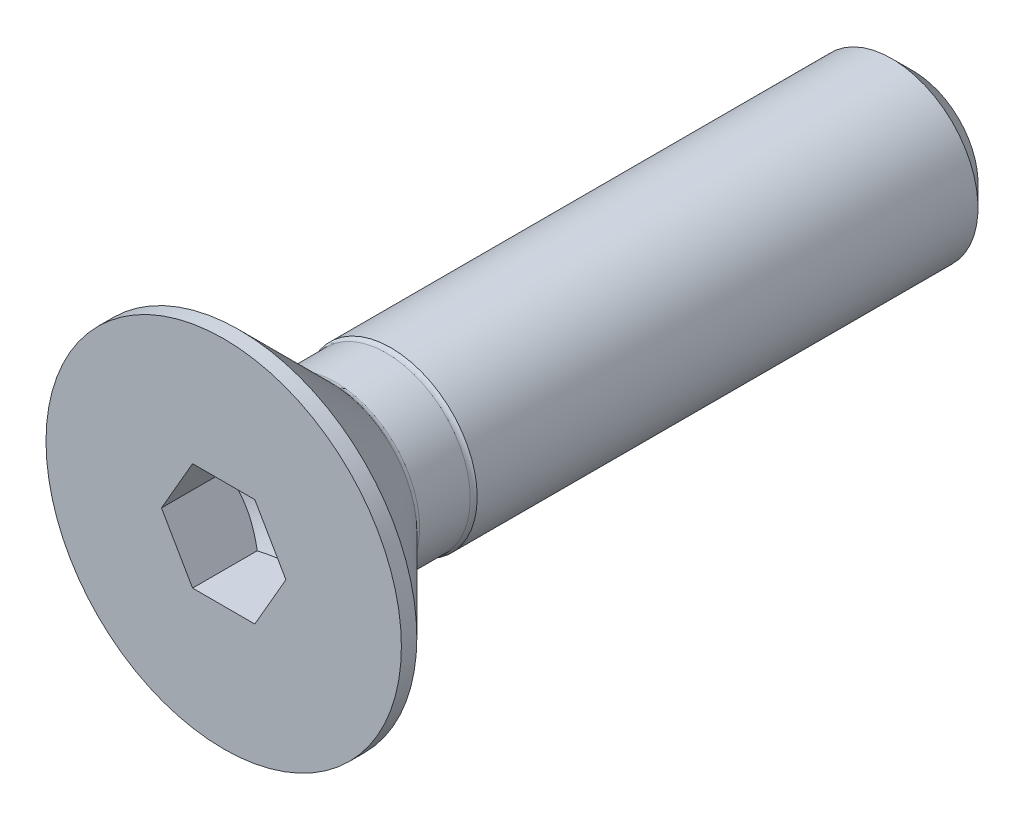
ISO-10303-21;
HEADER;
FILE_DESCRIPTION(('STEP AP214'),'2;1');
FILE_NAME('part.step','',(''),(''),'','','');
FILE_SCHEMA(('AUTOMOTIVE_DESIGN { 1 0 10303 214 1 1 1 1 }'));
ENDSEC;
DATA;
#1=APPLICATION_CONTEXT('core data for automotive mechanical design processes');
#2=APPLICATION_PROTOCOL_DEFINITION('international standard','automotive_design',2000,#1);
#3=PRODUCT_CONTEXT('',#1,'mechanical');
#4=PRODUCT('Part','Part','',(#3));
#5=PRODUCT_RELATED_PRODUCT_CATEGORY('part','',(#4));
#6=PRODUCT_DEFINITION_FORMATION('','',#4);
#7=PRODUCT_DEFINITION_CONTEXT('part definition',#1,'design');
#8=PRODUCT_DEFINITION('design','',#6,#7);
#9=PRODUCT_DEFINITION_SHAPE('','',#8);
#10=(LENGTH_UNIT() NAMED_UNIT(*) SI_UNIT(.MILLI.,.METRE.));
#11=(NAMED_UNIT(*) PLANE_ANGLE_UNIT() SI_UNIT($,.RADIAN.));
#12=(NAMED_UNIT(*) SI_UNIT($,.STERADIAN.) SOLID_ANGLE_UNIT());
#13=UNCERTAINTY_MEASURE_WITH_UNIT(LENGTH_MEASURE(1.E-05),#10,'distance_accuracy_value','');
#14=(GEOMETRIC_REPRESENTATION_CONTEXT(3) GLOBAL_UNCERTAINTY_ASSIGNED_CONTEXT((#13)) GLOBAL_UNIT_ASSIGNED_CONTEXT((#10,
#11,#12)) REPRESENTATION_CONTEXT('',''));
#15=CARTESIAN_POINT('',(0.,0.,0.));
#16=DIRECTION('',(0.,0.,1.));
#17=DIRECTION('',(1.,0.,0.));
#18=AXIS2_PLACEMENT_3D('',#15,#16,#17);
#19=CARTESIAN_POINT('',(0.,4.1225,0.));
#20=DIRECTION('',(0.,0.,-1.));
#21=DIRECTION('',(-1.,0.,0.));
#22=AXIS2_PLACEMENT_3D('',#19,#20,#21);
#23=PLANE('',#22);
#24=CARTESIAN_POINT('',(0.,0.,0.));
#25=DIRECTION('',(0.,0.,1.));
#26=DIRECTION('',(1.,0.,0.));
#27=AXIS2_PLACEMENT_3D('',#24,#25,#26);
#28=CIRCLE('',#27,4.1225);
#29=CARTESIAN_POINT('',(4.1225,0.,0.));
#30=VERTEX_POINT('',#29);
#31=EDGE_CURVE('E145',#30,#30,#28,.T.);
#32=ORIENTED_EDGE('',*,*,#31,.T.);
#33=EDGE_LOOP('',(#32));
#34=FACE_BOUND('',#33,.T.);
#35=DIRECTION('',(0.5,-0.866025403784439,0.));
#36=VECTOR('',#35,1.);
#37=CARTESIAN_POINT('',(0.7216875,1.24999941718736,0.));
#38=LINE('',#37,#36);
#39=CARTESIAN_POINT('',(0.7216875,1.24999941718736,0.));
#40=VERTEX_POINT('',#39);
#41=CARTESIAN_POINT('',(1.443375,0.,0.));
#42=VERTEX_POINT('',#41);
#43=EDGE_CURVE('E58',#40,#42,#38,.T.);
#44=ORIENTED_EDGE('',*,*,#43,.T.);
#45=DIRECTION('',(-0.5,-0.866025403784439,0.));
#46=VECTOR('',#45,1.);
#47=CARTESIAN_POINT('',(1.443375,0.,0.));
#48=LINE('',#47,#46);
#49=CARTESIAN_POINT('',(0.7216875,-1.24999941718736,0.));
#50=VERTEX_POINT('',#49);
#51=EDGE_CURVE('E172',#42,#50,#48,.T.);
#52=ORIENTED_EDGE('',*,*,#51,.T.);
#53=DIRECTION('',(-1.,0.,0.));
#54=VECTOR('',#53,1.);
#55=CARTESIAN_POINT('',(0.7216875,-1.24999941718736,0.));
#56=LINE('',#55,#54);
#57=CARTESIAN_POINT('',(-0.7216875,-1.24999941718736,0.));
#58=VERTEX_POINT('',#57);
#59=EDGE_CURVE('E478',#50,#58,#56,.T.);
#60=ORIENTED_EDGE('',*,*,#59,.T.);
#61=DIRECTION('',(-0.5,0.866025403784439,0.));
#62=VECTOR('',#61,1.);
#63=CARTESIAN_POINT('',(-0.7216875,-1.24999941718736,0.));
#64=LINE('',#63,#62);
#65=CARTESIAN_POINT('',(-1.443375,0.,0.));
#66=VERTEX_POINT('',#65);
#67=EDGE_CURVE('E474',#58,#66,#64,.T.);
#68=ORIENTED_EDGE('',*,*,#67,.T.);
#69=DIRECTION('',(0.5,0.866025403784439,0.));
#70=VECTOR('',#69,1.);
#71=CARTESIAN_POINT('',(-1.443375,0.,0.));
#72=LINE('',#71,#70);
#73=CARTESIAN_POINT('',(-0.7216875,1.24999941718736,0.));
#74=VERTEX_POINT('',#73);
#75=EDGE_CURVE('E130',#66,#74,#72,.T.);
#76=ORIENTED_EDGE('',*,*,#75,.T.);
#77=DIRECTION('',(1.,0.,0.));
#78=VECTOR('',#77,1.);
#79=CARTESIAN_POINT('',(-0.7216875,1.24999941718736,0.));
#80=LINE('',#79,#78);
#81=EDGE_CURVE('E122',#74,#40,#80,.T.);
#82=ORIENTED_EDGE('',*,*,#81,.T.);
#83=EDGE_LOOP('',(#44,#52,#60,#68,#76,#82));
#84=FACE_BOUND('',#83,.T.);
#85=ADVANCED_FACE('F43',(#34,#84),#23,.F.);
#86=CARTESIAN_POINT('',(0.,0.,-3.76786291501016));
#87=DIRECTION('',(0.,0.,1.));
#88=DIRECTION('',(1.,0.,0.));
#89=AXIS2_PLACEMENT_3D('',#86,#87,#88);
#90=TOROIDAL_SURFACE('',#89,2.11313708498985,0.16);
#91=CARTESIAN_POINT('',(0.,0.,-3.881));
#92=DIRECTION('',(0.,0.,-1.));
#93=DIRECTION('',(-1.,0.,0.));
#94=AXIS2_PLACEMENT_3D('',#91,#92,#93);
#95=CIRCLE('',#94,2.);
#96=CARTESIAN_POINT('',(-2.,0.,-3.881));
#97=VERTEX_POINT('',#96);
#98=EDGE_CURVE('E457',#97,#97,#95,.T.);
#99=ORIENTED_EDGE('',*,*,#98,.F.);
#100=EDGE_LOOP('',(#99));
#101=FACE_BOUND('',#100,.T.);
#102=CARTESIAN_POINT('',(0.,0.,-3.76786291501016));
#103=DIRECTION('',(0.,0.,1.));
#104=DIRECTION('',(1.,0.,0.));
#105=AXIS2_PLACEMENT_3D('',#102,#103,#104);
#106=CIRCLE('',#105,1.95313708498985);
#107=CARTESIAN_POINT('',(1.95313708498985,0.,-3.76786291501016));
#108=VERTEX_POINT('',#107);
#109=EDGE_CURVE('E256',#108,#108,#106,.T.);
#110=ORIENTED_EDGE('',*,*,#109,.F.);
#111=EDGE_LOOP('',(#110));
#112=FACE_BOUND('',#111,.T.);
#113=ADVANCED_FACE('F227',(#101,#112),#90,.F.);
#114=CARTESIAN_POINT('',(0.,0.,0.));
#115=DIRECTION('',(0.,0.,1.));
#116=DIRECTION('',(1.,0.,0.));
#117=AXIS2_PLACEMENT_3D('',#114,#115,#116);
#118=CYLINDRICAL_SURFACE('',#117,1.95313708498985);
#119=CARTESIAN_POINT('',(0.,0.,-2.59413708498985));
#120=DIRECTION('',(0.,0.,-1.));
#121=DIRECTION('',(-1.,0.,0.));
#122=AXIS2_PLACEMENT_3D('',#119,#120,#121);
#123=CIRCLE('',#122,1.95313708498985);
#124=CARTESIAN_POINT('',(-1.95313708498985,0.,-2.59413708498985));
#125=VERTEX_POINT('',#124);
#126=EDGE_CURVE('E254',#125,#125,#123,.T.);
#127=ORIENTED_EDGE('',*,*,#126,.T.);
#128=EDGE_LOOP('',(#127));
#129=FACE_BOUND('',#128,.T.);
#130=ORIENTED_EDGE('',*,*,#109,.T.);
#131=EDGE_LOOP('',(#130));
#132=FACE_BOUND('',#131,.T.);
#133=ADVANCED_FACE('F233',(#129,#132),#118,.T.);
#134=CARTESIAN_POINT('',(0.,0.,-2.481));
#135=DIRECTION('',(0.,0.,1.));
#136=DIRECTION('',(1.,0.,0.));
#137=AXIS2_PLACEMENT_3D('',#134,#135,#136);
#138=CONICAL_SURFACE('',#137,2.,0.785398163397448);
#139=CARTESIAN_POINT('',(0.,0.,-2.481));
#140=DIRECTION('',(0.,0.,1.));
#141=DIRECTION('',(1.,0.,0.));
#142=AXIS2_PLACEMENT_3D('',#139,#140,#141);
#143=CIRCLE('',#142,2.);
#144=CARTESIAN_POINT('',(2.,0.,-2.481));
#145=VERTEX_POINT('',#144);
#146=EDGE_CURVE('E251',#145,#145,#143,.T.);
#147=ORIENTED_EDGE('',*,*,#146,.T.);
#148=EDGE_LOOP('',(#147));
#149=FACE_BOUND('',#148,.T.);
#150=CARTESIAN_POINT('',(0.,0.,-0.3585));
#151=DIRECTION('',(0.,0.,1.));
#152=DIRECTION('',(1.,0.,0.));
#153=AXIS2_PLACEMENT_3D('',#150,#151,#152);
#154=CIRCLE('',#153,4.1225);
#155=CARTESIAN_POINT('',(4.1225,0.,-0.3585));
#156=VERTEX_POINT('',#155);
#157=EDGE_CURVE('E150',#156,#156,#154,.T.);
#158=ORIENTED_EDGE('',*,*,#157,.F.);
#159=EDGE_LOOP('',(#158));
#160=FACE_BOUND('',#159,.T.);
#161=ADVANCED_FACE('F289',(#149,#160),#138,.T.);
#162=CARTESIAN_POINT('',(0.,0.,0.));
#163=DIRECTION('',(0.,0.,1.));
#164=DIRECTION('',(1.,0.,0.));
#165=AXIS2_PLACEMENT_3D('',#162,#163,#164);
#166=CYLINDRICAL_SURFACE('',#165,4.1225);
#167=ORIENTED_EDGE('',*,*,#31,.F.);
#168=EDGE_LOOP('',(#167));
#169=FACE_BOUND('',#168,.T.);
#170=ORIENTED_EDGE('',*,*,#157,.T.);
#171=EDGE_LOOP('',(#170));
#172=FACE_BOUND('',#171,.T.);
#173=ADVANCED_FACE('F225',(#169,#172),#166,.T.);
#174=CARTESIAN_POINT('',(0.7216875,1.24999941718736,-2.33333294479158));
#175=DIRECTION('',(-0.866025403784439,-0.5,0.));
#176=DIRECTION('',(-0.5,0.866025403784438,0.));
#177=AXIS2_PLACEMENT_3D('',#174,#175,#176);
#178=PLANE('',#177);
#179=DIRECTION('',(0.,0.,1.));
#180=VECTOR('',#179,1.);
#181=CARTESIAN_POINT('',(1.443375,0.,-2.33333294479158));
#182=LINE('',#181,#180);
#183=CARTESIAN_POINT('',(1.443375,0.,-1.5));
#184=VERTEX_POINT('',#183);
#185=EDGE_CURVE('E142',#184,#42,#182,.T.);
#186=ORIENTED_EDGE('',*,*,#185,.T.);
#187=ORIENTED_EDGE('',*,*,#43,.F.);
#188=DIRECTION('',(0.,0.,1.));
#189=VECTOR('',#188,1.);
#190=CARTESIAN_POINT('',(0.7216875,1.24999941718736,-2.33333294479158));
#191=LINE('',#190,#189);
#192=CARTESIAN_POINT('',(0.7216875,1.24999941718736,-1.5));
#193=VERTEX_POINT('',#192);
#194=EDGE_CURVE('E115',#193,#40,#191,.T.);
#195=ORIENTED_EDGE('',*,*,#194,.F.);
#196=CARTESIAN_POINT('',(1.44337615470054,-2.0000000000854E-06,-1.49999933333253));
#197=CARTESIAN_POINT('',(1.41166234028678,0.0549279378664328,-1.51831466384599));
#198=CARTESIAN_POINT('',(1.37967477272109,0.110332030100753,-1.534971506758));
#199=CARTESIAN_POINT('',(1.31514579266581,0.222099502117095,-1.56404554497845));
#200=CARTESIAN_POINT('',(1.28260323398259,0.278464867164723,-1.57645245608369));
#201=CARTESIAN_POINT('',(1.2179214008177,0.390497088533009,-1.59576473395903));
#202=CARTESIAN_POINT('',(1.18579207575664,0.446146711951657,-1.60279864918316));
#203=CARTESIAN_POINT('',(1.12138232312734,0.557707676008561,-1.61119415112888));
#204=CARTESIAN_POINT('',(1.08910212951503,0.613618611423234,-1.6125626916718));
#205=CARTESIAN_POINT('',(1.02878989848834,0.718082459879302,-1.60970859848893));
#206=CARTESIAN_POINT('',(1.00074881136366,0.766651047478698,-1.60618673930223));
#207=CARTESIAN_POINT('',(0.944849315909161,0.863471813723364,-1.59502670475172));
#208=CARTESIAN_POINT('',(0.916991100780737,0.911723657733979,-1.58738472076412));
#209=CARTESIAN_POINT('',(0.860976444321451,1.00874388868998,-1.56828121424634));
#210=CARTESIAN_POINT('',(0.832827088932361,1.05750000242419,-1.55673874987155));
#211=CARTESIAN_POINT('',(0.776948107685497,1.15428523701895,-1.5305422256394));
#212=CARTESIAN_POINT('',(0.749217766489108,1.20231559688232,-1.51589431709011));
#213=CARTESIAN_POINT('',(0.721686345299461,1.25000141718736,-1.49999933333253));
#214=B_SPLINE_CURVE_WITH_KNOTS('',3,(#196,#197,#198,#199,#200,#201,#202,#203,#204,#205,#206,
#207,#208,#209,#210,#211,#212,#213),.UNSPECIFIED.,.F.,.F.,(4,2,2,2,2,2,2,2,4),(0.,
0.198135072963001,0.396746271230005,0.590442442133858,0.783900794935013,0.952318546997791,
1.12089225123217,1.29320414395206,1.46517785562982),.UNSPECIFIED.);
#215=EDGE_CURVE('E107',#184,#193,#214,.T.);
#216=ORIENTED_EDGE('',*,*,#215,.F.);
#217=EDGE_LOOP('',(#186,#187,#195,#216));
#218=FACE_BOUND('',#217,.T.);
#219=ADVANCED_FACE('F116',(#218),#178,.T.);
#220=CARTESIAN_POINT('',(1.443375,0.,-2.33333294479158));
#221=DIRECTION('',(-0.866025403784439,0.5,0.));
#222=DIRECTION('',(0.5,0.866025403784439,0.));
#223=AXIS2_PLACEMENT_3D('',#220,#221,#222);
#224=PLANE('',#223);
#225=DIRECTION('',(0.,0.,1.));
#226=VECTOR('',#225,1.);
#227=CARTESIAN_POINT('',(0.7216875,-1.24999941718736,-2.33333294479158));
#228=LINE('',#227,#226);
#229=CARTESIAN_POINT('',(0.7216875,-1.24999941718736,-1.5));
#230=VERTEX_POINT('',#229);
#231=EDGE_CURVE('E139',#230,#50,#228,.T.);
#232=ORIENTED_EDGE('',*,*,#231,.T.);
#233=ORIENTED_EDGE('',*,*,#51,.F.);
#234=ORIENTED_EDGE('',*,*,#185,.F.);
#235=CARTESIAN_POINT('',(0.721686345299462,-1.25000141718736,-1.49999933333253));
#236=CARTESIAN_POINT('',(0.753400159713217,-1.19507147932093,-1.51831466384599));
#237=CARTESIAN_POINT('',(0.785387727278908,-1.13966738708661,-1.534971506758));
#238=CARTESIAN_POINT('',(0.849916707334187,-1.02789991507027,-1.56404554497845));
#239=CARTESIAN_POINT('',(0.882459266017407,-0.971534550022641,-1.57645245608369));
#240=CARTESIAN_POINT('',(0.947141099182298,-0.859502328654354,-1.59576473395903));
#241=CARTESIAN_POINT('',(0.979270424243356,-0.803852705235707,-1.60279864918316));
#242=CARTESIAN_POINT('',(1.04368017687266,-0.692291741178803,-1.61119415112888));
#243=CARTESIAN_POINT('',(1.07596037048497,-0.63638080576413,-1.6125626916718));
#244=CARTESIAN_POINT('',(1.13627260151166,-0.531916957308062,-1.60970859848893));
#245=CARTESIAN_POINT('',(1.16431368863634,-0.483348369708666,-1.60618673930223));
#246=CARTESIAN_POINT('',(1.22021318409084,-0.386527603463999,-1.59502670475172));
#247=CARTESIAN_POINT('',(1.24807139921926,-0.338275759453384,-1.58738472076412));
#248=CARTESIAN_POINT('',(1.30408605567855,-0.241255528497385,-1.56828121424634));
#249=CARTESIAN_POINT('',(1.33223541106764,-0.192499414763169,-1.55673874987155));
#250=CARTESIAN_POINT('',(1.3881143923145,-0.095714180168412,-1.5305422256394));
#251=CARTESIAN_POINT('',(1.41584473351089,-0.0476838203050459,-1.51589431709011));
#252=CARTESIAN_POINT('',(1.44337615470054,2.00000000011121E-06,-1.49999933333253));
#253=B_SPLINE_CURVE_WITH_KNOTS('',3,(#235,#236,#237,#238,#239,#240,#241,#242,#243,#244,#245,
#246,#247,#248,#249,#250,#251,#252),.UNSPECIFIED.,.F.,.F.,(4,2,2,2,2,2,2,2,4),(0.,
0.198135072963001,0.396746271230005,0.590442442133857,0.783900794935012,0.95231854699779,
1.12089225123217,1.29320414395206,1.46517785562982),.UNSPECIFIED.);
#254=EDGE_CURVE('E111',#230,#184,#253,.T.);
#255=ORIENTED_EDGE('',*,*,#254,.F.);
#256=EDGE_LOOP('',(#232,#233,#234,#255));
#257=FACE_BOUND('',#256,.T.);
#258=ADVANCED_FACE('F216',(#257),#224,.T.);
#259=CARTESIAN_POINT('',(0.7216875,-1.24999941718736,-2.33333294479158));
#260=DIRECTION('',(0.,1.,0.));
#261=DIRECTION('',(1.,0.,0.));
#262=AXIS2_PLACEMENT_3D('',#259,#260,#261);
#263=PLANE('',#262);
#264=DIRECTION('',(0.,0.,1.));
#265=VECTOR('',#264,1.);
#266=CARTESIAN_POINT('',(-0.7216875,-1.24999941718736,-2.33333294479158));
#267=LINE('',#266,#265);
#268=CARTESIAN_POINT('',(-0.7216875,-1.24999941718736,-1.5));
#269=VERTEX_POINT('',#268);
#270=EDGE_CURVE('E136',#269,#58,#267,.T.);
#271=ORIENTED_EDGE('',*,*,#270,.T.);
#272=ORIENTED_EDGE('',*,*,#59,.F.);
#273=ORIENTED_EDGE('',*,*,#231,.F.);
#274=CARTESIAN_POINT('',(-1.86893053107489,-1.24999941718736,-1.03520610546338));
#275=CARTESIAN_POINT('',(-1.81495117776836,-1.24999941718736,-1.06110336553914));
#276=CARTESIAN_POINT('',(-1.76084043441986,-1.24999941718736,-1.08673156982417));
#277=CARTESIAN_POINT('',(-1.65228585942289,-1.24999941718736,-1.13729740698206));
#278=CARTESIAN_POINT('',(-1.59784196995446,-1.24999941718736,-1.16223491557562));
#279=CARTESIAN_POINT('',(-1.48823862830604,-1.24999941718736,-1.21140621587152));
#280=CARTESIAN_POINT('',(-1.43307683885742,-1.24999941718736,-1.235634821182));
#281=CARTESIAN_POINT('',(-1.32229127521218,-1.24999941718736,-1.28300502760232));
#282=CARTESIAN_POINT('',(-1.26666752521415,-1.24999941718736,-1.30614668523167));
#283=CARTESIAN_POINT('',(-1.15340030068293,-1.24999941718736,-1.35164545298225));
#284=CARTESIAN_POINT('',(-1.09574203904477,-1.24999941718736,-1.37396624053161));
#285=CARTESIAN_POINT('',(-0.979740631963517,-1.24999941718736,-1.4167445598185));
#286=CARTESIAN_POINT('',(-0.921397401730978,-1.24999941718736,-1.43720185807762));
#287=CARTESIAN_POINT('',(-0.745435180245369,-1.24999941718736,-1.4949157638346));
#288=CARTESIAN_POINT('',(-0.626561647576072,-1.24999941718736,-1.5286497713202));
#289=CARTESIAN_POINT('',(-0.445872875814715,-1.24999941718736,-1.56777956156641));
#290=CARTESIAN_POINT('',(-0.385304520505474,-1.24999941718736,-1.57890590259941));
#291=CARTESIAN_POINT('',(-0.263486469039549,-1.24999941718736,-1.59657210272847));
#292=CARTESIAN_POINT('',(-0.20223681921018,-1.24999941718736,-1.60311227176594));
#293=CARTESIAN_POINT('',(-0.0801324091719259,-1.24999941718736,-1.61100116721612));
#294=CARTESIAN_POINT('',(-0.0192817104364654,-1.24999941718736,-1.61241115633369));
#295=CARTESIAN_POINT('',(0.102319185361569,-1.24999941718736,-1.61008376076964));
#296=CARTESIAN_POINT('',(0.163069375967905,-1.24999941718736,-1.60634605736359));
#297=CARTESIAN_POINT('',(0.312961455362286,-1.24999941718736,-1.59110192923387));
#298=CARTESIAN_POINT('',(0.40181287263432,-1.24999941718736,-1.57673871507949));
#299=CARTESIAN_POINT('',(0.577787885436386,-1.24999941718736,-1.53970013003255));
#300=CARTESIAN_POINT('',(0.664909264565295,-1.24999941718736,-1.5170147409968));
#301=CARTESIAN_POINT('',(0.795208864990652,-1.24999941718736,-1.47826255341911));
#302=CARTESIAN_POINT('',(0.839060620655932,-1.24999941718736,-1.46437706854983));
#303=CARTESIAN_POINT('',(0.926307663712635,-1.24999941718736,-1.43532161198726));
#304=CARTESIAN_POINT('',(0.969703217226752,-1.24999941718736,-1.42015244191295));
#305=CARTESIAN_POINT('',(1.05609584795378,-1.24999941718736,-1.38874991589815));
#306=CARTESIAN_POINT('',(1.09909299597128,-1.24999941718736,-1.37251675335748));
#307=CARTESIAN_POINT('',(1.18474848915208,-1.24999941718736,-1.33916183010982));
#308=CARTESIAN_POINT('',(1.22740677566046,-1.24999941718736,-1.32203991927052));
#309=CARTESIAN_POINT('',(1.33629337906013,-1.24999941718736,-1.27723891874489));
#310=CARTESIAN_POINT('',(1.40230397627436,-1.24999941718736,-1.24903123787647));
#311=CARTESIAN_POINT('',(1.53372907463052,-1.24999941718736,-1.19125610878032));
#312=CARTESIAN_POINT('',(1.59914353067597,-1.24999941718736,-1.16168855868857));
#313=CARTESIAN_POINT('',(1.79469131828896,-1.24999941718736,-1.07142547137653));
#314=CARTESIAN_POINT('',(1.92410722703437,-1.24999941718736,-1.00917875067825));
#315=CARTESIAN_POINT('',(2.18183340208154,-1.24999941718736,-0.882074692722761));
#316=CARTESIAN_POINT('',(2.31014211360569,-1.24999941718736,-0.817214240230098));
#317=CARTESIAN_POINT('',(2.565880437641,-1.24999941718736,-0.685825560455861));
#318=CARTESIAN_POINT('',(2.69331015929244,-1.24999941718736,-0.619297545160823));
#319=CARTESIAN_POINT('',(2.93556233058972,-1.24999941718736,-0.491426204179085));
#320=CARTESIAN_POINT('',(3.05043950275986,-1.24999941718736,-0.430186190566507));
#321=CARTESIAN_POINT('',(3.27982431975772,-1.24999941718736,-0.307008392995773));
#322=CARTESIAN_POINT('',(3.39433195070739,-1.24999941718736,-0.245070583215423));
#323=CARTESIAN_POINT('',(3.62277162051502,-1.24999941718736,-0.120830385501942));
#324=CARTESIAN_POINT('',(3.73670438259663,-1.24999941718736,-0.0585293255792196));
#325=CARTESIAN_POINT('',(3.96433956104115,-1.24999941718736,0.0664782860853304));
#326=CARTESIAN_POINT('',(4.07804198914646,-1.24999941718736,0.129184816436423));
#327=CARTESIAN_POINT('',(4.19166166337244,-1.24999941718736,0.192040033810125));
#328=B_SPLINE_CURVE_WITH_KNOTS('',3,(#274,#275,#276,#277,#278,#279,#280,#281,#282,#283,#284,
#285,#286,#287,#288,#289,#290,#291,#292,#293,#294,#295,#296,#297,#298,#299,#300,#301,#302,#303,
#304,#305,#306,#307,#308,#309,#310,#311,#312,#313,#314,#315,#316,#317,#318,#319,#320,#321,#322,
#323,#324,#325,#326,#327),.UNSPECIFIED.,.F.,.F.,(4,2,2,2,2,2,2,2,2,2,2,2,2,2,2,2,2,2,2,2,2,2,2,
2,2,2,4),(0.,0.179612840817484,0.359257792773137,0.539992477393522,0.720717753677289,
0.906167353114827,1.09164015584897,1.46153946542598,1.64614477745769,1.83073761234132,
2.01311873652213,2.1955111535168,2.46497183475509,2.73475795996105,2.87273569413165,
3.01062789275234,3.14849509611698,3.28638566505407,3.50171816734966,3.71706682595868,
4.14783526963883,4.5791332693121,5.01037671616215,5.40091711572386,5.79147201515411,
6.18103353481212,6.57057466801426),.UNSPECIFIED.);
#329=EDGE_CURVE('E205',#269,#230,#328,.T.);
#330=ORIENTED_EDGE('',*,*,#329,.F.);
#331=EDGE_LOOP('',(#271,#272,#273,#330));
#332=FACE_BOUND('',#331,.T.);
#333=ADVANCED_FACE('F212',(#332),#263,.T.);
#334=CARTESIAN_POINT('',(-0.7216875,-1.24999941718736,-2.33333294479158));
#335=DIRECTION('',(0.866025403784439,0.5,0.));
#336=DIRECTION('',(0.5,-0.866025403784439,0.));
#337=AXIS2_PLACEMENT_3D('',#334,#335,#336);
#338=PLANE('',#337);
#339=DIRECTION('',(0.,0.,1.));
#340=VECTOR('',#339,1.);
#341=CARTESIAN_POINT('',(-1.443375,0.,-2.33333294479158));
#342=LINE('',#341,#340);
#343=CARTESIAN_POINT('',(-1.443375,0.,-1.5));
#344=VERTEX_POINT('',#343);
#345=EDGE_CURVE('E128',#344,#66,#342,.T.);
#346=ORIENTED_EDGE('',*,*,#345,.T.);
#347=ORIENTED_EDGE('',*,*,#67,.F.);
#348=ORIENTED_EDGE('',*,*,#270,.F.);
#349=CARTESIAN_POINT('',(-1.44337615470054,2.00000000041633E-06,-1.49999933333253));
#350=CARTESIAN_POINT('',(-1.41166234028678,-0.0549279378664328,-1.51831466384599));
#351=CARTESIAN_POINT('',(-1.37967477272109,-0.110332030100753,-1.534971506758));
#352=CARTESIAN_POINT('',(-1.31514579266581,-0.222099502117095,-1.56404554497845));
#353=CARTESIAN_POINT('',(-1.28260323398259,-0.278464867164722,-1.57645245608369));
#354=CARTESIAN_POINT('',(-1.2179214008177,-0.390497088533009,-1.59576473395903));
#355=CARTESIAN_POINT('',(-1.18579207575664,-0.446146711951657,-1.60279864918316));
#356=CARTESIAN_POINT('',(-1.12138232312734,-0.55770767600856,-1.61119415112888));
#357=CARTESIAN_POINT('',(-1.08910212951503,-0.613618611423234,-1.6125626916718));
#358=CARTESIAN_POINT('',(-1.02878989848834,-0.718082459879302,-1.60970859848893));
#359=CARTESIAN_POINT('',(-1.00074881136366,-0.766651047478698,-1.60618673930223));
#360=CARTESIAN_POINT('',(-0.944849315909161,-0.863471813723365,-1.59502670475172));
#361=CARTESIAN_POINT('',(-0.916991100780737,-0.911723657733979,-1.58738472076412));
#362=CARTESIAN_POINT('',(-0.860976444321451,-1.00874388868998,-1.56828121424634));
#363=CARTESIAN_POINT('',(-0.832827088932361,-1.05750000242419,-1.55673874987155));
#364=CARTESIAN_POINT('',(-0.776948107685497,-1.15428523701895,-1.5305422256394));
#365=CARTESIAN_POINT('',(-0.749217766489108,-1.20231559688232,-1.51589431709011));
#366=CARTESIAN_POINT('',(-0.721686345299461,-1.25000141718736,-1.49999933333253));
#367=B_SPLINE_CURVE_WITH_KNOTS('',3,(#349,#350,#351,#352,#353,#354,#355,#356,#357,#358,#359,
#360,#361,#362,#363,#364,#365,#366),.UNSPECIFIED.,.F.,.F.,(4,2,2,2,2,2,2,2,4),(0.,
0.198135072963001,0.396746271230005,0.590442442133858,0.783900794935013,0.952318546997791,
1.12089225123217,1.29320414395206,1.46517785562982),.UNSPECIFIED.);
#368=EDGE_CURVE('E199',#344,#269,#367,.T.);
#369=ORIENTED_EDGE('',*,*,#368,.F.);
#370=EDGE_LOOP('',(#346,#347,#348,#369));
#371=FACE_BOUND('',#370,.T.);
#372=ADVANCED_FACE('F215',(#371),#338,.T.);
#373=CARTESIAN_POINT('',(-1.443375,0.,-2.33333294479158));
#374=DIRECTION('',(0.866025403784439,-0.5,0.));
#375=DIRECTION('',(-0.5,-0.866025403784439,0.));
#376=AXIS2_PLACEMENT_3D('',#373,#374,#375);
#377=PLANE('',#376);
#378=DIRECTION('',(0.,0.,1.));
#379=VECTOR('',#378,1.);
#380=CARTESIAN_POINT('',(-0.7216875,1.24999941718736,-2.33333294479158));
#381=LINE('',#380,#379);
#382=CARTESIAN_POINT('',(-0.7216875,1.24999941718736,-1.5));
#383=VERTEX_POINT('',#382);
#384=EDGE_CURVE('E121',#383,#74,#381,.T.);
#385=ORIENTED_EDGE('',*,*,#384,.T.);
#386=ORIENTED_EDGE('',*,*,#75,.F.);
#387=ORIENTED_EDGE('',*,*,#345,.F.);
#388=CARTESIAN_POINT('',(-0.721686345299462,1.25000141718736,-1.49999933333253));
#389=CARTESIAN_POINT('',(-0.753400159713217,1.19507147932093,-1.51831466384599));
#390=CARTESIAN_POINT('',(-0.785387727278908,1.13966738708661,-1.534971506758));
#391=CARTESIAN_POINT('',(-0.849916707334187,1.02789991507027,-1.56404554497845));
#392=CARTESIAN_POINT('',(-0.882459266017407,0.971534550022641,-1.57645245608369));
#393=CARTESIAN_POINT('',(-0.947141099182299,0.859502328654354,-1.59576473395903));
#394=CARTESIAN_POINT('',(-0.979270424243356,0.803852705235707,-1.60279864918316));
#395=CARTESIAN_POINT('',(-1.04368017687266,0.692291741178803,-1.61119415112888));
#396=CARTESIAN_POINT('',(-1.07596037048497,0.636380805764129,-1.6125626916718));
#397=CARTESIAN_POINT('',(-1.13627260151166,0.531916957308061,-1.60970859848893));
#398=CARTESIAN_POINT('',(-1.16431368863634,0.483348369708665,-1.60618673930223));
#399=CARTESIAN_POINT('',(-1.22021318409084,0.386527603463999,-1.59502670475172));
#400=CARTESIAN_POINT('',(-1.24807139921926,0.338275759453385,-1.58738472076412));
#401=CARTESIAN_POINT('',(-1.30408605567855,0.241255528497386,-1.56828121424634));
#402=CARTESIAN_POINT('',(-1.33223541106764,0.192499414763169,-1.55673874987155));
#403=CARTESIAN_POINT('',(-1.3881143923145,0.0957141801684129,-1.5305422256394));
#404=CARTESIAN_POINT('',(-1.41584473351089,0.0476838203050468,-1.51589431709011));
#405=CARTESIAN_POINT('',(-1.44337615470054,-1.99999999949886E-06,-1.49999933333253));
#406=B_SPLINE_CURVE_WITH_KNOTS('',3,(#388,#389,#390,#391,#392,#393,#394,#395,#396,#397,#398,
#399,#400,#401,#402,#403,#404,#405),.UNSPECIFIED.,.F.,.F.,(4,2,2,2,2,2,2,2,4),(0.,
0.198135072963001,0.396746271230005,0.590442442133858,0.783900794935013,0.95231854699779,
1.12089225123217,1.29320414395206,1.46517785562982),.UNSPECIFIED.);
#407=EDGE_CURVE('E66',#383,#344,#406,.T.);
#408=ORIENTED_EDGE('',*,*,#407,.F.);
#409=EDGE_LOOP('',(#385,#386,#387,#408));
#410=FACE_BOUND('',#409,.T.);
#411=ADVANCED_FACE('F322',(#410),#377,.T.);
#412=CARTESIAN_POINT('',(-0.7216875,1.24999941718736,-2.33333294479158));
#413=DIRECTION('',(0.,-1.,0.));
#414=DIRECTION('',(-1.,0.,0.));
#415=AXIS2_PLACEMENT_3D('',#412,#413,#414);
#416=PLANE('',#415);
#417=ORIENTED_EDGE('',*,*,#194,.T.);
#418=ORIENTED_EDGE('',*,*,#81,.F.);
#419=ORIENTED_EDGE('',*,*,#384,.F.);
#420=CARTESIAN_POINT('',(-1.86893053107489,1.24999941718736,-1.03520610546338));
#421=CARTESIAN_POINT('',(-1.81495117776836,1.24999941718736,-1.06110336553914));
#422=CARTESIAN_POINT('',(-1.76084043441986,1.24999941718736,-1.08673156982417));
#423=CARTESIAN_POINT('',(-1.65228585942289,1.24999941718736,-1.13729740698206));
#424=CARTESIAN_POINT('',(-1.59784196995446,1.24999941718736,-1.16223491557562));
#425=CARTESIAN_POINT('',(-1.48823862830604,1.24999941718736,-1.21140621587152));
#426=CARTESIAN_POINT('',(-1.43307683885742,1.24999941718736,-1.235634821182));
#427=CARTESIAN_POINT('',(-1.32229127521218,1.24999941718736,-1.28300502760232));
#428=CARTESIAN_POINT('',(-1.26666752521415,1.24999941718736,-1.30614668523167));
#429=CARTESIAN_POINT('',(-1.15340030068293,1.24999941718736,-1.35164545298225));
#430=CARTESIAN_POINT('',(-1.09574203904477,1.24999941718736,-1.37396624053161));
#431=CARTESIAN_POINT('',(-0.979740631963518,1.24999941718736,-1.4167445598185));
#432=CARTESIAN_POINT('',(-0.921397401730978,1.24999941718736,-1.43720185807762));
#433=CARTESIAN_POINT('',(-0.74543518024537,1.24999941718736,-1.4949157638346));
#434=CARTESIAN_POINT('',(-0.626561647576073,1.24999941718736,-1.5286497713202));
#435=CARTESIAN_POINT('',(-0.445872875814716,1.24999941718736,-1.56777956156641));
#436=CARTESIAN_POINT('',(-0.385304520505475,1.24999941718736,-1.57890590259941));
#437=CARTESIAN_POINT('',(-0.26348646903955,1.24999941718736,-1.59657210272847));
#438=CARTESIAN_POINT('',(-0.202236819210181,1.24999941718736,-1.60311227176594));
#439=CARTESIAN_POINT('',(-0.0801324091719269,1.24999941718736,-1.61100116721612));
#440=CARTESIAN_POINT('',(-0.0192817104364664,1.24999941718736,-1.61241115633369));
#441=CARTESIAN_POINT('',(0.102319185361568,1.24999941718736,-1.61008376076964));
#442=CARTESIAN_POINT('',(0.163069375967904,1.24999941718736,-1.60634605736359));
#443=CARTESIAN_POINT('',(0.312961455362285,1.24999941718736,-1.59110192923387));
#444=CARTESIAN_POINT('',(0.401812872634318,1.24999941718736,-1.57673871507949));
#445=CARTESIAN_POINT('',(0.577787885436384,1.24999941718736,-1.53970013003255));
#446=CARTESIAN_POINT('',(0.664909264565294,1.24999941718736,-1.5170147409968));
#447=CARTESIAN_POINT('',(0.795208864990651,1.24999941718736,-1.47826255341911));
#448=CARTESIAN_POINT('',(0.83906062065593,1.24999941718736,-1.46437706854983));
#449=CARTESIAN_POINT('',(0.926307663712634,1.24999941718736,-1.43532161198726));
#450=CARTESIAN_POINT('',(0.96970321722675,1.24999941718736,-1.42015244191295));
#451=CARTESIAN_POINT('',(1.05609584795378,1.24999941718737,-1.38874991589815));
#452=CARTESIAN_POINT('',(1.09909299597128,1.24999941718737,-1.37251675335748));
#453=CARTESIAN_POINT('',(1.18474848915208,1.24999941718736,-1.33916183010982));
#454=CARTESIAN_POINT('',(1.22740677566045,1.24999941718736,-1.32203991927052));
#455=CARTESIAN_POINT('',(1.33629337906013,1.24999941718736,-1.27723891874489));
#456=CARTESIAN_POINT('',(1.40230397627436,1.24999941718736,-1.24903123787647));
#457=CARTESIAN_POINT('',(1.53372907463051,1.24999941718737,-1.19125610878032));
#458=CARTESIAN_POINT('',(1.59914353067597,1.24999941718737,-1.16168855868857));
#459=CARTESIAN_POINT('',(1.79469131828895,1.24999941718736,-1.07142547137653));
#460=CARTESIAN_POINT('',(1.92410722703437,1.24999941718737,-1.00917875067825));
#461=CARTESIAN_POINT('',(2.18183340208154,1.24999941718737,-0.882074692722761));
#462=CARTESIAN_POINT('',(2.31014211360569,1.24999941718737,-0.817214240230098));
#463=CARTESIAN_POINT('',(2.565880437641,1.24999941718737,-0.685825560455862));
#464=CARTESIAN_POINT('',(2.69331015929244,1.24999941718737,-0.619297545160823));
#465=CARTESIAN_POINT('',(2.93556233058972,1.24999941718737,-0.491426204179086));
#466=CARTESIAN_POINT('',(3.05043950275985,1.24999941718737,-0.430186190566508));
#467=CARTESIAN_POINT('',(3.27982431975771,1.24999941718737,-0.307008392995774));
#468=CARTESIAN_POINT('',(3.39433195070738,1.24999941718737,-0.245070583215424));
#469=CARTESIAN_POINT('',(3.62277162051502,1.24999941718737,-0.120830385501943));
#470=CARTESIAN_POINT('',(3.73670438259662,1.24999941718737,-0.0585293255792209));
#471=CARTESIAN_POINT('',(3.96433956104115,1.24999941718737,0.0664782860853295));
#472=CARTESIAN_POINT('',(4.07804198914646,1.24999941718737,0.129184816436422));
#473=CARTESIAN_POINT('',(4.19166166337243,1.24999941718737,0.192040033810125));
#474=B_SPLINE_CURVE_WITH_KNOTS('',3,(#420,#421,#422,#423,#424,#425,#426,#427,#428,#429,#430,
#431,#432,#433,#434,#435,#436,#437,#438,#439,#440,#441,#442,#443,#444,#445,#446,#447,#448,#449,
#450,#451,#452,#453,#454,#455,#456,#457,#458,#459,#460,#461,#462,#463,#464,#465,#466,#467,#468,
#469,#470,#471,#472,#473),.UNSPECIFIED.,.F.,.F.,(4,2,2,2,2,2,2,2,2,2,2,2,2,2,2,2,2,2,2,2,2,2,2,
2,2,2,4),(0.,0.179612840817484,0.359257792773137,0.539992477393522,0.720717753677288,
0.906167353114827,1.09164015584897,1.46153946542598,1.64614477745769,1.83073761234132,
2.01311873652213,2.1955111535168,2.46497183475509,2.73475795996105,2.87273569413165,
3.01062789275234,3.14849509611698,3.28638566505407,3.50171816734966,3.71706682595868,
4.14783526963882,4.5791332693121,5.01037671616214,5.40091711572385,5.7914720151541,
6.18103353481212,6.57057466801426),.UNSPECIFIED.);
#475=EDGE_CURVE('E108',#193,#383,#474,.F.);
#476=ORIENTED_EDGE('',*,*,#475,.F.);
#477=EDGE_LOOP('',(#417,#418,#419,#476));
#478=FACE_BOUND('',#477,.T.);
#479=ADVANCED_FACE('F103',(#478),#416,.T.);
#480=CARTESIAN_POINT('',(0.,0.,-2.33333294479158));
#481=DIRECTION('',(0.,0.,1.));
#482=DIRECTION('',(1.,0.,0.));
#483=AXIS2_PLACEMENT_3D('',#480,#481,#482);
#484=CONICAL_SURFACE('',#483,0.,1.0471975511966);
#485=CARTESIAN_POINT('',(0.,0.,-2.33333294479158));
#486=VERTEX_POINT('',#485);
#487=VERTEX_LOOP('',#486);
#488=FACE_BOUND('',#487,.T.);
#489=ORIENTED_EDGE('',*,*,#215,.T.);
#490=ORIENTED_EDGE('',*,*,#475,.T.);
#491=ORIENTED_EDGE('',*,*,#407,.T.);
#492=ORIENTED_EDGE('',*,*,#368,.T.);
#493=ORIENTED_EDGE('',*,*,#329,.T.);
#494=ORIENTED_EDGE('',*,*,#254,.T.);
#495=EDGE_LOOP('',(#489,#490,#491,#492,#493,#494));
#496=FACE_BOUND('',#495,.T.);
#497=ADVANCED_FACE('F99',(#488,#496),#484,.F.);
#498=CARTESIAN_POINT('',(0.,0.,-16.));
#499=DIRECTION('',(0.,0.,1.));
#500=DIRECTION('',(1.,0.,0.));
#501=AXIS2_PLACEMENT_3D('',#498,#499,#500);
#502=CYLINDRICAL_SURFACE('',#501,2.);
#503=CARTESIAN_POINT('',(0.,0.,-15.5));
#504=DIRECTION('',(0.,0.,-1.));
#505=DIRECTION('',(-1.,0.,0.));
#506=AXIS2_PLACEMENT_3D('',#503,#504,#505);
#507=CIRCLE('',#506,2.);
#508=CARTESIAN_POINT('',(-2.,0.,-15.5));
#509=VERTEX_POINT('',#508);
#510=EDGE_CURVE('E12',#509,#509,#507,.F.);
#511=ORIENTED_EDGE('',*,*,#510,.T.);
#512=EDGE_LOOP('',(#511));
#513=FACE_BOUND('',#512,.T.);
#514=ORIENTED_EDGE('',*,*,#98,.T.);
#515=EDGE_LOOP('',(#514));
#516=FACE_BOUND('',#515,.T.);
#517=ADVANCED_FACE('F102',(#513,#516),#502,.T.);
#518=CARTESIAN_POINT('',(0.,0.,-16.));
#519=DIRECTION('',(0.,0.,-1.));
#520=DIRECTION('',(-1.,0.,0.));
#521=AXIS2_PLACEMENT_3D('',#518,#519,#520);
#522=PLANE('',#521);
#523=CARTESIAN_POINT('',(0.,0.,-16.));
#524=DIRECTION('',(0.,0.,-1.));
#525=DIRECTION('',(-1.,0.,0.));
#526=AXIS2_PLACEMENT_3D('',#523,#524,#525);
#527=CIRCLE('',#526,1.5);
#528=CARTESIAN_POINT('',(-1.5,0.,-16.));
#529=VERTEX_POINT('',#528);
#530=EDGE_CURVE('E51',#529,#529,#527,.T.);
#531=ORIENTED_EDGE('',*,*,#530,.T.);
#532=EDGE_LOOP('',(#531));
#533=FACE_BOUND('',#532,.T.);
#534=ADVANCED_FACE('F240',(#533),#522,.T.);
#535=CARTESIAN_POINT('',(0.,0.,-2.59413708498985));
#536=DIRECTION('',(0.,0.,-1.));
#537=DIRECTION('',(-1.,0.,0.));
#538=AXIS2_PLACEMENT_3D('',#535,#536,#537);
#539=TOROIDAL_SURFACE('',#538,2.11313708498985,0.16);
#540=ORIENTED_EDGE('',*,*,#146,.F.);
#541=EDGE_LOOP('',(#540));
#542=FACE_BOUND('',#541,.T.);
#543=ORIENTED_EDGE('',*,*,#126,.F.);
#544=EDGE_LOOP('',(#543));
#545=FACE_BOUND('',#544,.T.);
#546=ADVANCED_FACE('F238',(#542,#545),#539,.F.);
#547=CARTESIAN_POINT('',(0.,0.,-16.));
#548=DIRECTION('',(0.,0.,1.));
#549=DIRECTION('',(1.,0.,0.));
#550=AXIS2_PLACEMENT_3D('',#547,#548,#549);
#551=CONICAL_SURFACE('',#550,1.5,0.785398163397445);
#552=ORIENTED_EDGE('',*,*,#510,.F.);
#553=EDGE_LOOP('',(#552));
#554=FACE_BOUND('',#553,.T.);
#555=ORIENTED_EDGE('',*,*,#530,.F.);
#556=EDGE_LOOP('',(#555));
#557=FACE_BOUND('',#556,.T.);
#558=ADVANCED_FACE('F45',(#554,#557),#551,.T.);
#559=CLOSED_SHELL('',(#85,#113,#133,#161,#173,#219,#258,#333,#372,#411,#479,#497,#517,#534,#546,#558));
#560=MANIFOLD_SOLID_BREP('B2',#559);
#561=ADVANCED_BREP_SHAPE_REPRESENTATION('',(#18,#560),#14);
#562=SHAPE_DEFINITION_REPRESENTATION(#9,#561);
ENDSEC;
END-ISO-10303-21;
